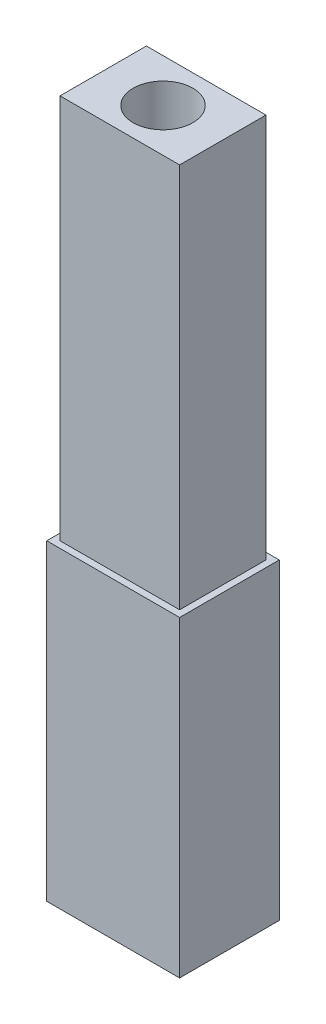
ISO-10303-21;
HEADER;
FILE_DESCRIPTION(('STEP AP214'),'2;1');
FILE_NAME('part.step','',(''),(''),'','','');
FILE_SCHEMA(('AUTOMOTIVE_DESIGN { 1 0 10303 214 1 1 1 1 }'));
ENDSEC;
DATA;
#1=APPLICATION_CONTEXT('core data for automotive mechanical design processes');
#2=APPLICATION_PROTOCOL_DEFINITION('international standard','automotive_design',2000,#1);
#3=PRODUCT_CONTEXT('',#1,'mechanical');
#4=PRODUCT('Part','Part','',(#3));
#5=PRODUCT_RELATED_PRODUCT_CATEGORY('part','',(#4));
#6=PRODUCT_DEFINITION_FORMATION('','',#4);
#7=PRODUCT_DEFINITION_CONTEXT('part definition',#1,'design');
#8=PRODUCT_DEFINITION('design','',#6,#7);
#9=PRODUCT_DEFINITION_SHAPE('','',#8);
#10=(LENGTH_UNIT() NAMED_UNIT(*) SI_UNIT(.MILLI.,.METRE.));
#11=(NAMED_UNIT(*) PLANE_ANGLE_UNIT() SI_UNIT($,.RADIAN.));
#12=(NAMED_UNIT(*) SI_UNIT($,.STERADIAN.) SOLID_ANGLE_UNIT());
#13=UNCERTAINTY_MEASURE_WITH_UNIT(LENGTH_MEASURE(1.E-05),#10,'distance_accuracy_value','');
#14=(GEOMETRIC_REPRESENTATION_CONTEXT(3) GLOBAL_UNCERTAINTY_ASSIGNED_CONTEXT((#13)) GLOBAL_UNIT_ASSIGNED_CONTEXT((#10,
#11,#12)) REPRESENTATION_CONTEXT('',''));
#15=CARTESIAN_POINT('',(0.,0.,0.));
#16=DIRECTION('',(0.,0.,1.));
#17=DIRECTION('',(1.,0.,0.));
#18=AXIS2_PLACEMENT_3D('',#15,#16,#17);
#19=CARTESIAN_POINT('',(0.,47.,0.));
#20=DIRECTION('',(0.,-1.,0.));
#21=DIRECTION('',(0.,0.,-1.));
#22=AXIS2_PLACEMENT_3D('',#19,#20,#21);
#23=PLANE('',#22);
#24=DIRECTION('',(0.,0.,1.));
#25=VECTOR('',#24,1.);
#26=CARTESIAN_POINT('',(0.,47.,0.));
#27=LINE('',#26,#25);
#28=CARTESIAN_POINT('',(0.,47.,-15.));
#29=VERTEX_POINT('',#28);
#30=CARTESIAN_POINT('',(0.,47.,0.));
#31=VERTEX_POINT('',#30);
#32=EDGE_CURVE('E133',#29,#31,#27,.T.);
#33=ORIENTED_EDGE('',*,*,#32,.T.);
#34=DIRECTION('',(1.,0.,0.));
#35=VECTOR('',#34,1.);
#36=CARTESIAN_POINT('',(0.,47.,0.));
#37=LINE('',#36,#35);
#38=CARTESIAN_POINT('',(20.,47.,0.));
#39=VERTEX_POINT('',#38);
#40=EDGE_CURVE('E136',#31,#39,#37,.T.);
#41=ORIENTED_EDGE('',*,*,#40,.T.);
#42=DIRECTION('',(0.,0.,-1.));
#43=VECTOR('',#42,1.);
#44=CARTESIAN_POINT('',(20.,47.,0.));
#45=LINE('',#44,#43);
#46=CARTESIAN_POINT('',(20.,47.,-15.));
#47=VERTEX_POINT('',#46);
#48=EDGE_CURVE('E139',#39,#47,#45,.T.);
#49=ORIENTED_EDGE('',*,*,#48,.T.);
#50=DIRECTION('',(-1.,0.,0.));
#51=VECTOR('',#50,1.);
#52=CARTESIAN_POINT('',(0.,47.,-15.));
#53=LINE('',#52,#51);
#54=EDGE_CURVE('E141',#47,#29,#53,.T.);
#55=ORIENTED_EDGE('',*,*,#54,.T.);
#56=EDGE_LOOP('',(#33,#41,#49,#55));
#57=FACE_BOUND('',#56,.T.);
#58=DIRECTION('',(0.,0.,1.));
#59=VECTOR('',#58,1.);
#60=CARTESIAN_POINT('',(1.,47.,-14.));
#61=LINE('',#60,#59);
#62=CARTESIAN_POINT('',(1.,47.,-14.));
#63=VERTEX_POINT('',#62);
#64=CARTESIAN_POINT('',(1.,47.,-1.));
#65=VERTEX_POINT('',#64);
#66=EDGE_CURVE('E54',#63,#65,#61,.T.);
#67=ORIENTED_EDGE('',*,*,#66,.F.);
#68=DIRECTION('',(-1.,0.,0.));
#69=VECTOR('',#68,1.);
#70=CARTESIAN_POINT('',(1.,47.,-14.));
#71=LINE('',#70,#69);
#72=CARTESIAN_POINT('',(19.,47.,-14.));
#73=VERTEX_POINT('',#72);
#74=EDGE_CURVE('E58',#73,#63,#71,.T.);
#75=ORIENTED_EDGE('',*,*,#74,.F.);
#76=DIRECTION('',(0.,0.,-1.));
#77=VECTOR('',#76,1.);
#78=CARTESIAN_POINT('',(19.,47.,-14.));
#79=LINE('',#78,#77);
#80=CARTESIAN_POINT('',(19.,47.,-1.));
#81=VERTEX_POINT('',#80);
#82=EDGE_CURVE('E283',#81,#73,#79,.T.);
#83=ORIENTED_EDGE('',*,*,#82,.F.);
#84=DIRECTION('',(1.,0.,0.));
#85=VECTOR('',#84,1.);
#86=CARTESIAN_POINT('',(1.,47.,-1.));
#87=LINE('',#86,#85);
#88=EDGE_CURVE('E274',#65,#81,#87,.T.);
#89=ORIENTED_EDGE('',*,*,#88,.F.);
#90=EDGE_LOOP('',(#67,#75,#83,#89));
#91=FACE_BOUND('',#90,.T.);
#92=ADVANCED_FACE('F39',(#57,#91),#23,.F.);
#93=CARTESIAN_POINT('',(0.,47.,0.));
#94=DIRECTION('',(1.,0.,0.));
#95=DIRECTION('',(0.,0.,-1.));
#96=AXIS2_PLACEMENT_3D('',#93,#94,#95);
#97=PLANE('',#96);
#98=DIRECTION('',(0.,0.,1.));
#99=VECTOR('',#98,1.);
#100=CARTESIAN_POINT('',(0.,0.,0.));
#101=LINE('',#100,#99);
#102=CARTESIAN_POINT('',(0.,0.,-15.));
#103=VERTEX_POINT('',#102);
#104=CARTESIAN_POINT('',(0.,0.,0.));
#105=VERTEX_POINT('',#104);
#106=EDGE_CURVE('E124',#103,#105,#101,.T.);
#107=ORIENTED_EDGE('',*,*,#106,.T.);
#108=DIRECTION('',(0.,-1.,0.));
#109=VECTOR('',#108,1.);
#110=CARTESIAN_POINT('',(0.,47.,0.));
#111=LINE('',#110,#109);
#112=EDGE_CURVE('E11',#31,#105,#111,.T.);
#113=ORIENTED_EDGE('',*,*,#112,.F.);
#114=ORIENTED_EDGE('',*,*,#32,.F.);
#115=DIRECTION('',(0.,-1.,0.));
#116=VECTOR('',#115,1.);
#117=CARTESIAN_POINT('',(0.,47.,-15.));
#118=LINE('',#117,#116);
#119=EDGE_CURVE('E142',#29,#103,#118,.T.);
#120=ORIENTED_EDGE('',*,*,#119,.T.);
#121=EDGE_LOOP('',(#107,#113,#114,#120));
#122=FACE_BOUND('',#121,.T.);
#123=ADVANCED_FACE('F41',(#122),#97,.F.);
#124=CARTESIAN_POINT('',(0.,47.,0.));
#125=DIRECTION('',(0.,0.,-1.));
#126=DIRECTION('',(-1.,0.,0.));
#127=AXIS2_PLACEMENT_3D('',#124,#125,#126);
#128=PLANE('',#127);
#129=DIRECTION('',(1.,0.,0.));
#130=VECTOR('',#129,1.);
#131=CARTESIAN_POINT('',(0.,0.,0.));
#132=LINE('',#131,#130);
#133=CARTESIAN_POINT('',(20.,0.,0.));
#134=VERTEX_POINT('',#133);
#135=EDGE_CURVE('E127',#105,#134,#132,.T.);
#136=ORIENTED_EDGE('',*,*,#135,.T.);
#137=DIRECTION('',(0.,-1.,0.));
#138=VECTOR('',#137,1.);
#139=CARTESIAN_POINT('',(20.,47.,0.));
#140=LINE('',#139,#138);
#141=EDGE_CURVE('E47',#39,#134,#140,.T.);
#142=ORIENTED_EDGE('',*,*,#141,.F.);
#143=ORIENTED_EDGE('',*,*,#40,.F.);
#144=ORIENTED_EDGE('',*,*,#112,.T.);
#145=EDGE_LOOP('',(#136,#142,#143,#144));
#146=FACE_BOUND('',#145,.T.);
#147=ADVANCED_FACE('F172',(#146),#128,.F.);
#148=CARTESIAN_POINT('',(20.,47.,0.));
#149=DIRECTION('',(-1.,0.,0.));
#150=DIRECTION('',(0.,0.,1.));
#151=AXIS2_PLACEMENT_3D('',#148,#149,#150);
#152=PLANE('',#151);
#153=DIRECTION('',(0.,0.,-1.));
#154=VECTOR('',#153,1.);
#155=CARTESIAN_POINT('',(20.,0.,0.));
#156=LINE('',#155,#154);
#157=CARTESIAN_POINT('',(20.,0.,-15.));
#158=VERTEX_POINT('',#157);
#159=EDGE_CURVE('E145',#134,#158,#156,.T.);
#160=ORIENTED_EDGE('',*,*,#159,.T.);
#161=DIRECTION('',(0.,-1.,0.));
#162=VECTOR('',#161,1.);
#163=CARTESIAN_POINT('',(20.,47.,-15.));
#164=LINE('',#163,#162);
#165=EDGE_CURVE('E150',#47,#158,#164,.T.);
#166=ORIENTED_EDGE('',*,*,#165,.F.);
#167=ORIENTED_EDGE('',*,*,#48,.F.);
#168=ORIENTED_EDGE('',*,*,#141,.T.);
#169=EDGE_LOOP('',(#160,#166,#167,#168));
#170=FACE_BOUND('',#169,.T.);
#171=ADVANCED_FACE('F157',(#170),#152,.F.);
#172=CARTESIAN_POINT('',(0.,47.,-15.));
#173=DIRECTION('',(0.,0.,1.));
#174=DIRECTION('',(1.,0.,0.));
#175=AXIS2_PLACEMENT_3D('',#172,#173,#174);
#176=PLANE('',#175);
#177=DIRECTION('',(-1.,0.,0.));
#178=VECTOR('',#177,1.);
#179=CARTESIAN_POINT('',(0.,0.,-15.));
#180=LINE('',#179,#178);
#181=EDGE_CURVE('E137',#158,#103,#180,.T.);
#182=ORIENTED_EDGE('',*,*,#181,.T.);
#183=ORIENTED_EDGE('',*,*,#119,.F.);
#184=ORIENTED_EDGE('',*,*,#54,.F.);
#185=ORIENTED_EDGE('',*,*,#165,.T.);
#186=EDGE_LOOP('',(#182,#183,#184,#185));
#187=FACE_BOUND('',#186,.T.);
#188=ADVANCED_FACE('F166',(#187),#176,.F.);
#189=CARTESIAN_POINT('',(0.,0.,0.));
#190=DIRECTION('',(0.,-1.,0.));
#191=DIRECTION('',(0.,0.,-1.));
#192=AXIS2_PLACEMENT_3D('',#189,#190,#191);
#193=PLANE('',#192);
#194=ORIENTED_EDGE('',*,*,#106,.F.);
#195=ORIENTED_EDGE('',*,*,#181,.F.);
#196=ORIENTED_EDGE('',*,*,#159,.F.);
#197=ORIENTED_EDGE('',*,*,#135,.F.);
#198=EDGE_LOOP('',(#194,#195,#196,#197));
#199=FACE_BOUND('',#198,.T.);
#200=ADVANCED_FACE('F163',(#199),#193,.T.);
#201=CARTESIAN_POINT('',(1.,105.,-14.));
#202=DIRECTION('',(1.,0.,0.));
#203=DIRECTION('',(0.,0.,-1.));
#204=AXIS2_PLACEMENT_3D('',#201,#202,#203);
#205=PLANE('',#204);
#206=ORIENTED_EDGE('',*,*,#66,.T.);
#207=DIRECTION('',(0.,-1.,0.));
#208=VECTOR('',#207,1.);
#209=CARTESIAN_POINT('',(1.,105.,-1.));
#210=LINE('',#209,#208);
#211=CARTESIAN_POINT('',(1.,105.,-1.));
#212=VERTEX_POINT('',#211);
#213=EDGE_CURVE('E107',#212,#65,#210,.T.);
#214=ORIENTED_EDGE('',*,*,#213,.F.);
#215=DIRECTION('',(0.,0.,1.));
#216=VECTOR('',#215,1.);
#217=CARTESIAN_POINT('',(1.,105.,-14.));
#218=LINE('',#217,#216);
#219=CARTESIAN_POINT('',(1.,105.,-14.));
#220=VERTEX_POINT('',#219);
#221=EDGE_CURVE('E113',#220,#212,#218,.T.);
#222=ORIENTED_EDGE('',*,*,#221,.F.);
#223=DIRECTION('',(0.,-1.,0.));
#224=VECTOR('',#223,1.);
#225=CARTESIAN_POINT('',(1.,105.,-14.));
#226=LINE('',#225,#224);
#227=EDGE_CURVE('E280',#220,#63,#226,.T.);
#228=ORIENTED_EDGE('',*,*,#227,.T.);
#229=EDGE_LOOP('',(#206,#214,#222,#228));
#230=FACE_BOUND('',#229,.T.);
#231=ADVANCED_FACE('F123',(#230),#205,.F.);
#232=CARTESIAN_POINT('',(1.,105.,-1.));
#233=DIRECTION('',(0.,0.,-1.));
#234=DIRECTION('',(-1.,0.,0.));
#235=AXIS2_PLACEMENT_3D('',#232,#233,#234);
#236=PLANE('',#235);
#237=ORIENTED_EDGE('',*,*,#88,.T.);
#238=DIRECTION('',(0.,-1.,0.));
#239=VECTOR('',#238,1.);
#240=CARTESIAN_POINT('',(19.,105.,-1.));
#241=LINE('',#240,#239);
#242=CARTESIAN_POINT('',(19.,105.,-1.));
#243=VERTEX_POINT('',#242);
#244=EDGE_CURVE('E109',#243,#81,#241,.T.);
#245=ORIENTED_EDGE('',*,*,#244,.F.);
#246=DIRECTION('',(1.,0.,0.));
#247=VECTOR('',#246,1.);
#248=CARTESIAN_POINT('',(1.,105.,-1.));
#249=LINE('',#248,#247);
#250=EDGE_CURVE('E102',#212,#243,#249,.T.);
#251=ORIENTED_EDGE('',*,*,#250,.F.);
#252=ORIENTED_EDGE('',*,*,#213,.T.);
#253=EDGE_LOOP('',(#237,#245,#251,#252));
#254=FACE_BOUND('',#253,.T.);
#255=ADVANCED_FACE('F105',(#254),#236,.F.);
#256=CARTESIAN_POINT('',(19.,105.,-14.));
#257=DIRECTION('',(-1.,0.,0.));
#258=DIRECTION('',(0.,0.,1.));
#259=AXIS2_PLACEMENT_3D('',#256,#257,#258);
#260=PLANE('',#259);
#261=ORIENTED_EDGE('',*,*,#82,.T.);
#262=DIRECTION('',(0.,-1.,0.));
#263=VECTOR('',#262,1.);
#264=CARTESIAN_POINT('',(19.,105.,-14.));
#265=LINE('',#264,#263);
#266=CARTESIAN_POINT('',(19.,105.,-14.));
#267=VERTEX_POINT('',#266);
#268=EDGE_CURVE('E129',#267,#73,#265,.T.);
#269=ORIENTED_EDGE('',*,*,#268,.F.);
#270=DIRECTION('',(0.,0.,-1.));
#271=VECTOR('',#270,1.);
#272=CARTESIAN_POINT('',(19.,105.,-14.));
#273=LINE('',#272,#271);
#274=EDGE_CURVE('E112',#243,#267,#273,.T.);
#275=ORIENTED_EDGE('',*,*,#274,.F.);
#276=ORIENTED_EDGE('',*,*,#244,.T.);
#277=EDGE_LOOP('',(#261,#269,#275,#276));
#278=FACE_BOUND('',#277,.T.);
#279=ADVANCED_FACE('F219',(#278),#260,.F.);
#280=CARTESIAN_POINT('',(1.,105.,-14.));
#281=DIRECTION('',(0.,0.,1.));
#282=DIRECTION('',(1.,0.,0.));
#283=AXIS2_PLACEMENT_3D('',#280,#281,#282);
#284=PLANE('',#283);
#285=ORIENTED_EDGE('',*,*,#74,.T.);
#286=ORIENTED_EDGE('',*,*,#227,.F.);
#287=DIRECTION('',(-1.,0.,0.));
#288=VECTOR('',#287,1.);
#289=CARTESIAN_POINT('',(1.,105.,-14.));
#290=LINE('',#289,#288);
#291=EDGE_CURVE('E118',#267,#220,#290,.T.);
#292=ORIENTED_EDGE('',*,*,#291,.F.);
#293=ORIENTED_EDGE('',*,*,#268,.T.);
#294=EDGE_LOOP('',(#285,#286,#292,#293));
#295=FACE_BOUND('',#294,.T.);
#296=ADVANCED_FACE('F227',(#295),#284,.F.);
#297=CARTESIAN_POINT('',(0.,105.,0.));
#298=DIRECTION('',(0.,1.,0.));
#299=DIRECTION('',(0.,0.,1.));
#300=AXIS2_PLACEMENT_3D('',#297,#298,#299);
#301=PLANE('',#300);
#302=CARTESIAN_POINT('',(10.,105.,-7.5));
#303=DIRECTION('',(0.,1.,0.));
#304=DIRECTION('',(0.,0.,1.));
#305=AXIS2_PLACEMENT_3D('',#302,#303,#304);
#306=CIRCLE('',#305,4.5);
#307=CARTESIAN_POINT('',(10.,105.,-3.));
#308=VERTEX_POINT('',#307);
#309=EDGE_CURVE('E272',#308,#308,#306,.T.);
#310=ORIENTED_EDGE('',*,*,#309,.F.);
#311=EDGE_LOOP('',(#310));
#312=FACE_BOUND('',#311,.T.);
#313=ORIENTED_EDGE('',*,*,#221,.T.);
#314=ORIENTED_EDGE('',*,*,#250,.T.);
#315=ORIENTED_EDGE('',*,*,#274,.T.);
#316=ORIENTED_EDGE('',*,*,#291,.T.);
#317=EDGE_LOOP('',(#313,#314,#315,#316));
#318=FACE_BOUND('',#317,.T.);
#319=ADVANCED_FACE('F116',(#312,#318),#301,.T.);
#320=CARTESIAN_POINT('',(10.,47.,-7.5));
#321=DIRECTION('',(0.,1.,0.));
#322=DIRECTION('',(0.,0.,1.));
#323=AXIS2_PLACEMENT_3D('',#320,#321,#322);
#324=CYLINDRICAL_SURFACE('',#323,4.5);
#325=CARTESIAN_POINT('',(10.,47.,-7.5));
#326=DIRECTION('',(0.,1.,0.));
#327=DIRECTION('',(0.,0.,1.));
#328=AXIS2_PLACEMENT_3D('',#325,#326,#327);
#329=CIRCLE('',#328,4.5);
#330=CARTESIAN_POINT('',(10.,47.,-3.));
#331=VERTEX_POINT('',#330);
#332=EDGE_CURVE('E271',#331,#331,#329,.T.);
#333=ORIENTED_EDGE('',*,*,#332,.F.);
#334=EDGE_LOOP('',(#333));
#335=FACE_BOUND('',#334,.T.);
#336=ORIENTED_EDGE('',*,*,#309,.T.);
#337=EDGE_LOOP('',(#336));
#338=FACE_BOUND('',#337,.T.);
#339=ADVANCED_FACE('F246',(#335,#338),#324,.F.);
#340=CARTESIAN_POINT('',(10.,47.,-7.5));
#341=DIRECTION('',(0.,1.,0.));
#342=DIRECTION('',(0.,0.,1.));
#343=AXIS2_PLACEMENT_3D('',#340,#341,#342);
#344=PLANE('',#343);
#345=ORIENTED_EDGE('',*,*,#332,.T.);
#346=EDGE_LOOP('',(#345));
#347=FACE_BOUND('',#346,.T.);
#348=ADVANCED_FACE('F256',(#347),#344,.T.);
#349=CLOSED_SHELL('',(#92,#123,#147,#171,#188,#200,#231,#255,#279,#296,#319,#339,#348));
#350=MANIFOLD_SOLID_BREP('B2',#349);
#351=ADVANCED_BREP_SHAPE_REPRESENTATION('',(#18,#350),#14);
#352=SHAPE_DEFINITION_REPRESENTATION(#9,#351);
ENDSEC;
END-ISO-10303-21;
